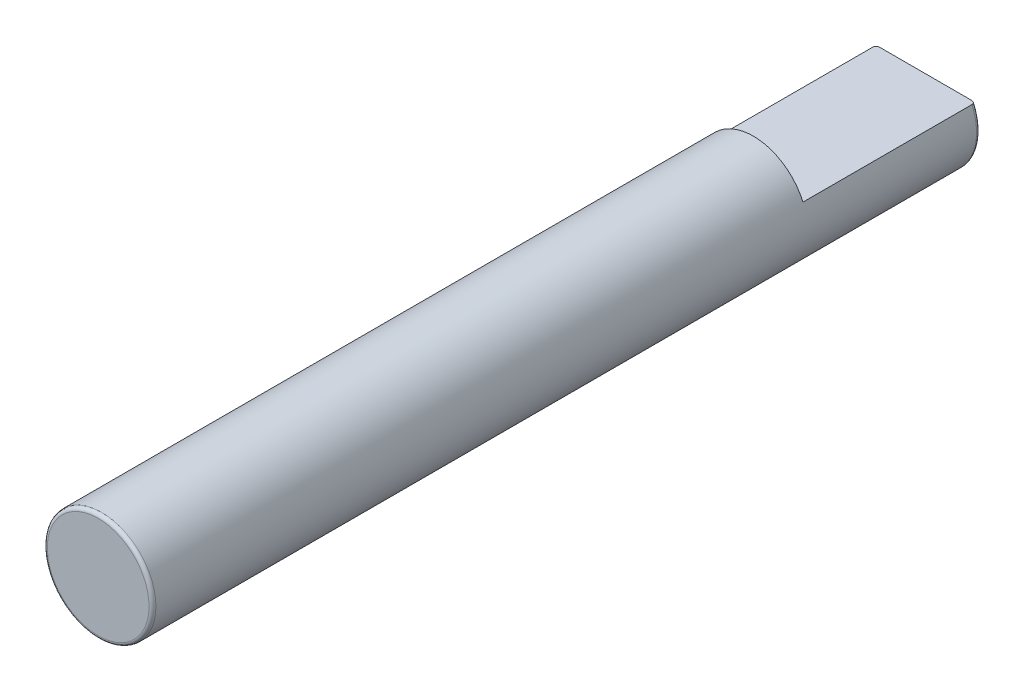
ISO-10303-21;
HEADER;
FILE_DESCRIPTION(('STEP AP214'),'2;1');
FILE_NAME('part.step','',(''),(''),'','','');
FILE_SCHEMA(('AUTOMOTIVE_DESIGN { 1 0 10303 214 1 1 1 1 }'));
ENDSEC;
DATA;
#1=APPLICATION_CONTEXT('core data for automotive mechanical design processes');
#2=APPLICATION_PROTOCOL_DEFINITION('international standard','automotive_design',2000,#1);
#3=PRODUCT_CONTEXT('',#1,'mechanical');
#4=PRODUCT('Part','Part','',(#3));
#5=PRODUCT_RELATED_PRODUCT_CATEGORY('part','',(#4));
#6=PRODUCT_DEFINITION_FORMATION('','',#4);
#7=PRODUCT_DEFINITION_CONTEXT('part definition',#1,'design');
#8=PRODUCT_DEFINITION('design','',#6,#7);
#9=PRODUCT_DEFINITION_SHAPE('','',#8);
#10=(LENGTH_UNIT() NAMED_UNIT(*) SI_UNIT(.MILLI.,.METRE.));
#11=(NAMED_UNIT(*) PLANE_ANGLE_UNIT() SI_UNIT($,.RADIAN.));
#12=(NAMED_UNIT(*) SI_UNIT($,.STERADIAN.) SOLID_ANGLE_UNIT());
#13=UNCERTAINTY_MEASURE_WITH_UNIT(LENGTH_MEASURE(1.E-05),#10,'distance_accuracy_value','');
#14=(GEOMETRIC_REPRESENTATION_CONTEXT(3) GLOBAL_UNCERTAINTY_ASSIGNED_CONTEXT((#13)) GLOBAL_UNIT_ASSIGNED_CONTEXT((#10,
#11,#12)) REPRESENTATION_CONTEXT('',''));
#15=CARTESIAN_POINT('',(0.,0.,0.));
#16=DIRECTION('',(0.,0.,1.));
#17=DIRECTION('',(1.,0.,0.));
#18=AXIS2_PLACEMENT_3D('',#15,#16,#17);
#19=CARTESIAN_POINT('',(0.,0.,60.9599999999998));
#20=DIRECTION('',(0.,0.,-0.999999999999996));
#21=DIRECTION('',(-0.999999999999998,0.,0.));
#22=AXIS2_PLACEMENT_3D('',#19,#20,#21);
#23=CYLINDRICAL_SURFACE('',#22,4.);
#24=CARTESIAN_POINT('',(0.,0.,60.7059999999998));
#25=DIRECTION('',(0.,0.,0.999999999999996));
#26=DIRECTION('',(0.999999999999998,0.,0.));
#27=AXIS2_PLACEMENT_3D('',#24,#25,#26);
#28=CIRCLE('',#27,4.);
#29=CARTESIAN_POINT('',(3.99999999999999,0.,60.7059999999998));
#30=VERTEX_POINT('',#29);
#31=EDGE_CURVE('E86',#30,#30,#28,.F.);
#32=ORIENTED_EDGE('',*,*,#31,.T.);
#33=EDGE_LOOP('',(#32));
#34=FACE_BOUND('',#33,.T.);
#35=DIRECTION('',(0.,0.,-0.999999999999996));
#36=VECTOR('',#35,1.);
#37=CARTESIAN_POINT('',(3.65782017566473,1.61875,60.9599999999998));
#38=LINE('',#37,#36);
#39=CARTESIAN_POINT('',(3.65782017566473,1.61875,12.6999999999999));
#40=VERTEX_POINT('',#39);
#41=CARTESIAN_POINT('',(3.65782017566474,1.61875,0.253999999999997));
#42=VERTEX_POINT('',#41);
#43=EDGE_CURVE('E49',#40,#42,#38,.T.);
#44=ORIENTED_EDGE('',*,*,#43,.F.);
#45=CARTESIAN_POINT('',(0.,0.,12.6999999999999));
#46=DIRECTION('',(0.,0.,0.999999999999996));
#47=DIRECTION('',(0.999999999999998,0.,0.));
#48=AXIS2_PLACEMENT_3D('',#45,#46,#47);
#49=CIRCLE('',#48,4.);
#50=CARTESIAN_POINT('',(-3.65782017566473,1.61875,12.6999999999999));
#51=VERTEX_POINT('',#50);
#52=EDGE_CURVE('E11',#40,#51,#49,.T.);
#53=ORIENTED_EDGE('',*,*,#52,.T.);
#54=DIRECTION('',(0.,0.,-0.999999999999996));
#55=VECTOR('',#54,1.);
#56=CARTESIAN_POINT('',(-3.65782017566473,1.61875,60.9599999999998));
#57=LINE('',#56,#55);
#58=CARTESIAN_POINT('',(-3.65782017566478,1.61875,0.25399999999999));
#59=VERTEX_POINT('',#58);
#60=EDGE_CURVE('E116',#59,#51,#57,.F.);
#61=ORIENTED_EDGE('',*,*,#60,.F.);
#62=CARTESIAN_POINT('',(0.,0.,0.253999999999997));
#63=DIRECTION('',(0.,0.,0.999999999999996));
#64=DIRECTION('',(0.999999999999998,0.,0.));
#65=AXIS2_PLACEMENT_3D('',#62,#63,#64);
#66=CIRCLE('',#65,4.);
#67=EDGE_CURVE('E82',#59,#42,#66,.T.);
#68=ORIENTED_EDGE('',*,*,#67,.T.);
#69=EDGE_LOOP('',(#44,#53,#61,#68));
#70=FACE_BOUND('',#69,.T.);
#71=ADVANCED_FACE('F34',(#34,#70),#23,.T.);
#72=CARTESIAN_POINT('',(0.,0.,0.));
#73=DIRECTION('',(0.,0.,0.999999999999996));
#74=DIRECTION('',(0.999999999999998,0.,0.));
#75=AXIS2_PLACEMENT_3D('',#72,#73,#74);
#76=PLANE('',#75);
#77=DIRECTION('',(-0.999999999999998,0.,0.));
#78=VECTOR('',#77,1.);
#79=CARTESIAN_POINT('',(-4.,1.61875,0.));
#80=LINE('',#79,#78);
#81=CARTESIAN_POINT('',(3.37818952066044,1.61875,0.));
#82=VERTEX_POINT('',#81);
#83=CARTESIAN_POINT('',(-3.37818952066021,1.61875,0.));
#84=VERTEX_POINT('',#83);
#85=EDGE_CURVE('E68',#82,#84,#80,.T.);
#86=ORIENTED_EDGE('',*,*,#85,.F.);
#87=CARTESIAN_POINT('',(0.,0.,0.));
#88=DIRECTION('',(0.,0.,0.999999999999996));
#89=DIRECTION('',(0.999999999999998,0.,0.));
#90=AXIS2_PLACEMENT_3D('',#87,#88,#89);
#91=CIRCLE('',#90,3.746);
#92=EDGE_CURVE('E78',#82,#84,#91,.F.);
#93=ORIENTED_EDGE('',*,*,#92,.T.);
#94=EDGE_LOOP('',(#86,#93));
#95=FACE_BOUND('',#94,.T.);
#96=ADVANCED_FACE('F77',(#95),#76,.F.);
#97=CARTESIAN_POINT('',(0.,0.,0.253999999999997));
#98=DIRECTION('',(0.,0.,0.999999999999996));
#99=DIRECTION('',(0.999999999999998,0.,0.));
#100=AXIS2_PLACEMENT_3D('',#97,#98,#99);
#101=TOROIDAL_SURFACE('',#100,3.746,0.254);
#102=ORIENTED_EDGE('',*,*,#67,.F.);
#103=CARTESIAN_POINT('',(-3.62181401029122,1.61875,0.128978152235386));
#104=CARTESIAN_POINT('',(-3.61398100741203,1.61875,0.116332868092589));
#105=CARTESIAN_POINT('',(-3.60499833058836,1.61875,0.104379057985489));
#106=CARTESIAN_POINT('',(-3.58510523117487,1.61875,0.0821753522248256));
#107=CARTESIAN_POINT('',(-3.57419032771626,1.61875,0.071929527040061));
#108=CARTESIAN_POINT('',(-3.55088235209229,1.61875,0.0534067069765182));
#109=CARTESIAN_POINT('',(-3.53849582960428,1.61875,0.0451214454608487));
#110=CARTESIAN_POINT('',(-3.51259207934814,1.61875,0.0305910436690785));
#111=CARTESIAN_POINT('',(-3.499075245087,1.61875,0.0243451970742181));
#112=CARTESIAN_POINT('',(-3.47026213419757,1.61875,0.0135799414975824));
#113=CARTESIAN_POINT('',(-3.45490774425881,1.61875,0.00921616349727985));
#114=CARTESIAN_POINT('',(-3.42370546383288,1.61875,0.00292866365241733));
#115=CARTESIAN_POINT('',(-3.40785734502239,1.61875,0.00100608842400553));
#116=CARTESIAN_POINT('',(-3.37486395077688,1.61875,-0.000451053260198092));
#117=CARTESIAN_POINT('',(-3.35771011762626,1.61875,0.000203257378076626));
#118=CARTESIAN_POINT('',(-3.32373504572483,1.61875,0.00430197449285581));
#119=CARTESIAN_POINT('',(-3.30691390441417,1.61875,0.00774718633750881));
#120=CARTESIAN_POINT('',(-3.27364563042085,1.61875,0.0175016071478172));
#121=CARTESIAN_POINT('',(-3.25721930953345,1.61875,0.0238823394233315));
#122=CARTESIAN_POINT('',(-3.22573916202948,1.61875,0.0394387348123291));
#123=CARTESIAN_POINT('',(-3.21068521983859,1.61875,0.0486141622886523));
#124=CARTESIAN_POINT('',(-3.1831849002841,1.61875,0.0691196856713148));
#125=CARTESIAN_POINT('',(-3.17065027930504,1.61875,0.0803308835619763));
#126=CARTESIAN_POINT('',(-3.14792190721115,1.61875,0.104921767549499));
#127=CARTESIAN_POINT('',(-3.13772619710203,1.61875,0.118299622783743));
#128=CARTESIAN_POINT('',(-3.12117462795611,1.61875,0.145306348564071));
#129=CARTESIAN_POINT('',(-3.11452425558573,1.61875,0.158754482092552));
#130=CARTESIAN_POINT('',(-3.10389679400881,1.61875,0.186667479671797));
#131=CARTESIAN_POINT('',(-3.09991729099644,1.61875,0.201131412593926));
#132=CARTESIAN_POINT('',(-3.09514752365418,1.61875,0.228944077381445));
#133=CARTESIAN_POINT('',(-3.09405601064955,1.61875,0.24224172558983));
#134=CARTESIAN_POINT('',(-3.09423765911792,1.61875,0.268819013521798));
#135=CARTESIAN_POINT('',(-3.09551009252322,1.61875,0.282098657529909));
#136=CARTESIAN_POINT('',(-3.10024145739033,1.61875,0.307636781843702));
#137=CARTESIAN_POINT('',(-3.10359906826337,1.61875,0.319914296348765));
#138=CARTESIAN_POINT('',(-3.11225527221652,1.61875,0.343762034653607));
#139=CARTESIAN_POINT('',(-3.11755405888834,1.61875,0.355332187774535));
#140=CARTESIAN_POINT('',(-3.13011150273258,1.61875,0.377921511844274));
#141=CARTESIAN_POINT('',(-3.13743599677487,1.61875,0.388903937975194));
#142=CARTESIAN_POINT('',(-3.15367608130174,1.61875,0.40961828405039));
#143=CARTESIAN_POINT('',(-3.16259221275837,1.61875,0.419349776882033));
#144=CARTESIAN_POINT('',(-3.1826404359309,1.61875,0.438261654854698));
#145=CARTESIAN_POINT('',(-3.19390194390374,1.61875,0.447304692491038));
#146=CARTESIAN_POINT('',(-3.21765700781537,1.61875,0.463591005191308));
#147=CARTESIAN_POINT('',(-3.23015110486586,1.61875,0.470833484847535));
#148=CARTESIAN_POINT('',(-3.25745815373513,1.61875,0.48412072664563));
#149=CARTESIAN_POINT('',(-3.27237569907739,1.61875,0.489950854321782));
#150=CARTESIAN_POINT('',(-3.30293418249766,1.61875,0.49923151068731));
#151=CARTESIAN_POINT('',(-3.31857542122114,1.61875,0.502681040754926));
#152=CARTESIAN_POINT('',(-3.35144851114196,1.61875,0.507330105142755));
#153=CARTESIAN_POINT('',(-3.368708721609,1.61875,0.508331376129597));
#154=CARTESIAN_POINT('',(-3.40316227055325,1.61875,0.507476394971046));
#155=CARTESIAN_POINT('',(-3.42035559292257,1.61875,0.505619492641897));
#156=CARTESIAN_POINT('',(-3.45446747244591,1.61875,0.498986906093992));
#157=CARTESIAN_POINT('',(-3.47137695924445,1.61875,0.494164058419906));
#158=CARTESIAN_POINT('',(-3.50407946280268,1.61875,0.481597414973423));
#159=CARTESIAN_POINT('',(-3.5198727015325,1.61875,0.473854201878129));
#160=CARTESIAN_POINT('',(-3.54898677094753,1.61875,0.456036639009788));
#161=CARTESIAN_POINT('',(-3.56239280191804,1.61875,0.446101993041197));
#162=CARTESIAN_POINT('',(-3.58713034734495,1.61875,0.423915186825961));
#163=CARTESIAN_POINT('',(-3.59846318683158,1.61875,0.411664517063966));
#164=CARTESIAN_POINT('',(-3.61760219650977,1.61875,0.38640260456888));
#165=CARTESIAN_POINT('',(-3.62563655293575,1.61875,0.373564302244797));
#166=CARTESIAN_POINT('',(-3.63919321751739,1.61875,0.346624240820025));
#167=CARTESIAN_POINT('',(-3.64471728080441,1.61875,0.332523372754929));
#168=CARTESIAN_POINT('',(-3.65261858051439,1.61875,0.304800146604606));
#169=CARTESIAN_POINT('',(-3.65522891154338,1.61875,0.29124391595927));
#170=CARTESIAN_POINT('',(-3.65801606285598,1.61875,0.263879903833329));
#171=CARTESIAN_POINT('',(-3.65819291019628,1.61875,0.250072125151271));
#172=CARTESIAN_POINT('',(-3.65615328996531,1.61875,0.22326775294229));
#173=CARTESIAN_POINT('',(-3.65404460975097,1.61875,0.210262698329947));
#174=CARTESIAN_POINT('',(-3.6476914105691,1.61875,0.184800623650788));
#175=CARTESIAN_POINT('',(-3.64345010213989,1.61875,0.172342810309825));
#176=CARTESIAN_POINT('',(-3.63587998810218,1.61875,0.154908360796537));
#177=CARTESIAN_POINT('',(-3.63332962291312,1.61875,0.149581126952593));
#178=CARTESIAN_POINT('',(-3.62785118410896,1.61875,0.139125683743482));
#179=CARTESIAN_POINT('',(-3.62492316477155,1.61875,0.133997445915469));
#180=CARTESIAN_POINT('',(-3.62181401029122,1.61875,0.128978152235386));
#181=B_SPLINE_CURVE_WITH_KNOTS('',3,(#103,#104,#105,#106,#107,#108,#109,#110,#111,#112,#113,
#114,#115,#116,#117,#118,#119,#120,#121,#122,#123,#124,#125,#126,#127,#128,#129,#130,#131,#132,
#133,#134,#135,#136,#137,#138,#139,#140,#141,#142,#143,#144,#145,#146,#147,#148,#149,#150,#151,
#152,#153,#154,#155,#156,#157,#158,#159,#160,#161,#162,#163,#164,#165,#166,#167,#168,#169,#170,
#171,#172,#173,#174,#175,#176,#177,#178,#179,#180),.UNSPECIFIED.,.T.,.F.,(4,2,2,2,2,2,2,2,2,2,2,
2,2,2,2,2,2,2,2,2,2,2,2,2,2,2,2,2,2,2,2,2,2,2,2,2,2,2,4),(0.,0.0446006683930118,
0.0893061548162654,0.133819642686237,0.178317697628841,0.226001785138876,0.273708261262,
0.324974214806307,0.376254967398297,0.428857340372456,0.48145527935891,0.531627259884261,
0.581757063331,0.626511473413867,0.671225381909631,0.711048088541356,0.750858532280906,
0.788871425204954,0.826888110152996,0.866325389994383,0.905776099545367,0.948927810930965,
0.99209855111631,1.03994429875017,1.08781010471284,1.13943992189654,1.19108148568421,
1.24356626451531,1.2960405770143,1.34582734410687,1.39558217916475,1.44077149653073,
1.48592916991068,1.52713470037598,1.56833977269723,1.60768288135366,1.64696693795985,
1.66467282687054,1.68237617386255),.UNSPECIFIED.);
#182=EDGE_CURVE('E42',#59,#84,#181,.T.);
#183=ORIENTED_EDGE('',*,*,#182,.T.);
#184=ORIENTED_EDGE('',*,*,#92,.F.);
#185=CARTESIAN_POINT('',(3.13034317773494,1.61875,0.130371957233907));
#186=CARTESIAN_POINT('',(3.13839747443689,1.61875,0.117533162173874));
#187=CARTESIAN_POINT('',(3.14764108889792,1.61875,0.105417931444454));
#188=CARTESIAN_POINT('',(3.16808370881694,1.61875,0.0829396574830406));
#189=CARTESIAN_POINT('',(3.17928794137144,1.61875,0.0725814477170629));
#190=CARTESIAN_POINT('',(3.20316399490995,1.61875,0.0538703022835363));
#191=CARTESIAN_POINT('',(3.21582804334547,1.61875,0.0455074134278668));
#192=CARTESIAN_POINT('',(3.24227954789428,1.61875,0.0308348386995946));
#193=CARTESIAN_POINT('',(3.25606651770586,1.61875,0.0245242698819539));
#194=CARTESIAN_POINT('',(3.28564404467436,1.61875,0.0135651973022127));
#195=CARTESIAN_POINT('',(3.30150494604995,1.61875,0.0091062731935187));
#196=CARTESIAN_POINT('',(3.33373474252849,1.61875,0.00273846028514944));
#197=CARTESIAN_POINT('',(3.35010389110342,1.61875,0.000830865479645672));
#198=CARTESIAN_POINT('',(3.38396219394872,1.61875,-0.000433251613529319));
#199=CARTESIAN_POINT('',(3.40145782876279,1.61875,0.000375838076135407));
#200=CARTESIAN_POINT('',(3.43606664310797,1.61875,0.00493431138370316));
#201=CARTESIAN_POINT('',(3.45317978156389,1.61875,0.00868400923965323));
#202=CARTESIAN_POINT('',(3.48639571846827,1.61875,0.0190716068750624));
#203=CARTESIAN_POINT('',(3.50250412904266,1.61875,0.0256914341618911));
#204=CARTESIAN_POINT('',(3.53326502219776,1.61875,0.0417335830406829));
#205=CARTESIAN_POINT('',(3.54791804170074,1.61875,0.0511548659594255));
#206=CARTESIAN_POINT('',(3.57423921364383,1.61875,0.0718784383303416));
#207=CARTESIAN_POINT('',(3.58604293434653,1.61875,0.0830081233504902));
#208=CARTESIAN_POINT('',(3.60736963865266,1.61875,0.107274549702716));
#209=CARTESIAN_POINT('',(3.61689420902809,1.61875,0.120409884179404));
#210=CARTESIAN_POINT('',(3.63242044846038,1.61875,0.146954934897744));
#211=CARTESIAN_POINT('',(3.63867156173112,1.61875,0.160218856478231));
#212=CARTESIAN_POINT('',(3.64864431308947,1.61875,0.187665388987166));
#213=CARTESIAN_POINT('',(3.65236737376046,1.61875,0.201847478315209));
#214=CARTESIAN_POINT('',(3.65692036816769,1.61875,0.229541857392628));
#215=CARTESIAN_POINT('',(3.65795138695942,1.61875,0.243021382166566));
#216=CARTESIAN_POINT('',(3.65766232327528,1.61875,0.269953689668082));
#217=CARTESIAN_POINT('',(3.65634276832219,1.61875,0.283406477717701));
#218=CARTESIAN_POINT('',(3.65148210004946,1.61875,0.309503440538761));
#219=CARTESIAN_POINT('',(3.64800547921946,1.61875,0.322159735666903));
#220=CARTESIAN_POINT('',(3.63902815652003,1.61875,0.346730559964342));
#221=CARTESIAN_POINT('',(3.63352733260823,1.61875,0.358645044358064));
#222=CARTESIAN_POINT('',(3.62053968515282,1.61875,0.381736908966185));
#223=CARTESIAN_POINT('',(3.61300576828472,1.61875,0.392887724144168));
#224=CARTESIAN_POINT('',(3.59628348079892,1.61875,0.413867795776895));
#225=CARTESIAN_POINT('',(3.58709469534384,1.61875,0.423696719782406));
#226=CARTESIAN_POINT('',(3.566676067186,1.61875,0.442471000443588));
#227=CARTESIAN_POINT('',(3.55535030606958,1.61875,0.451311896112469));
#228=CARTESIAN_POINT('',(3.53147660330034,1.61875,0.467147755228701));
#229=CARTESIAN_POINT('',(3.51892822783036,1.61875,0.474142060165337));
#230=CARTESIAN_POINT('',(3.49179120858802,1.61875,0.486733810952615));
#231=CARTESIAN_POINT('',(3.47712021898487,1.61875,0.492153811073807));
#232=CARTESIAN_POINT('',(3.44711717688314,1.61875,0.50066033619895));
#233=CARTESIAN_POINT('',(3.43178487038082,1.61875,0.503745956006175));
#234=CARTESIAN_POINT('',(3.39957867331268,1.61875,0.50772515698929));
#235=CARTESIAN_POINT('',(3.38268025122165,1.61875,0.50842167982394));
#236=CARTESIAN_POINT('',(3.3489883525918,1.61875,0.507089655497947));
#237=CARTESIAN_POINT('',(3.33219491214679,1.61875,0.50506021787734));
#238=CARTESIAN_POINT('',(3.29848028627019,1.61875,0.498175973858587));
#239=CARTESIAN_POINT('',(3.28158164787276,1.61875,0.493209691187999));
#240=CARTESIAN_POINT('',(3.24888705078697,1.61875,0.480434534465604));
#241=CARTESIAN_POINT('',(3.23309116236914,1.61875,0.472625479460508));
#242=CARTESIAN_POINT('',(3.20357117096325,1.61875,0.454534783644636));
#243=CARTESIAN_POINT('',(3.18980209281233,1.61875,0.444326916063163));
#244=CARTESIAN_POINT('',(3.1644030640058,1.61875,0.421520921251957));
#245=CARTESIAN_POINT('',(3.15277170075269,1.61875,0.40892438371436));
#246=CARTESIAN_POINT('',(3.13322928086671,1.61875,0.382972675815295));
#247=CARTESIAN_POINT('',(3.12506843827149,1.61875,0.369806063671296));
#248=CARTESIAN_POINT('',(3.11141487756136,1.61875,0.342156677858247));
#249=CARTESIAN_POINT('',(3.1059193649219,1.61875,0.327675301684349));
#250=CARTESIAN_POINT('',(3.09839356274576,1.61875,0.299638696182311));
#251=CARTESIAN_POINT('',(3.09603510652369,1.61875,0.286171060221083));
#252=CARTESIAN_POINT('',(3.09378728998864,1.61875,0.259028005312438));
#253=CARTESIAN_POINT('',(3.09389762836625,1.61875,0.245352611924814));
#254=CARTESIAN_POINT('',(3.09649236260838,1.61875,0.219128643453705));
#255=CARTESIAN_POINT('',(3.09882296290801,1.61875,0.206564337740496));
#256=CARTESIAN_POINT('',(3.10552457230202,1.61875,0.182007643022044));
#257=CARTESIAN_POINT('',(3.1098926080206,1.61875,0.170014448569238));
#258=CARTESIAN_POINT('',(3.11739455207491,1.61875,0.153614609623933));
#259=CARTESIAN_POINT('',(3.11977128258789,1.61875,0.148848163648749));
#260=CARTESIAN_POINT('',(3.12483085094726,1.61875,0.13948205435958));
#261=CARTESIAN_POINT('',(3.12751362228078,1.61875,0.134882355091251));
#262=CARTESIAN_POINT('',(3.13034317773494,1.61875,0.130371957233907));
#263=B_SPLINE_CURVE_WITH_KNOTS('',3,(#185,#186,#187,#188,#189,#190,#191,#192,#193,#194,#195,
#196,#197,#198,#199,#200,#201,#202,#203,#204,#205,#206,#207,#208,#209,#210,#211,#212,#213,#214,
#215,#216,#217,#218,#219,#220,#221,#222,#223,#224,#225,#226,#227,#228,#229,#230,#231,#232,#233,
#234,#235,#236,#237,#238,#239,#240,#241,#242,#243,#244,#245,#246,#247,#248,#249,#250,#251,#252,
#253,#254,#255,#256,#257,#258,#259,#260,#261,#262),.UNSPECIFIED.,.T.,.F.,(4,2,2,2,2,2,2,2,2,2,2,
2,2,2,2,2,2,2,2,2,2,2,2,2,2,2,2,2,2,2,2,2,2,2,2,2,2,2,4),(0.,0.0454465878241624,
0.0910162374601058,0.136353584859531,0.181671401433813,0.230886040408686,0.280125630822288,
0.332420066252598,0.384720090710726,0.436695471822343,0.488651606415995,0.537056145459689,
0.585426885985957,0.629181807957461,0.672912087750843,0.713267814002199,0.753614484641569,
0.792809408447018,0.832006695762704,0.872204140112423,0.912411675095333,0.955333894484817,
0.998271399708549,1.0449932565598,1.09173322135383,1.14224624378265,1.19277577076659,
1.24535891504751,1.2979454070313,1.34908809882037,1.40019687315568,1.44640500241456,
1.49256457843019,1.53336651508608,1.57416347200792,1.61232544103291,1.65043189097219,
1.66640119852286,1.6823670419986),.UNSPECIFIED.);
#264=EDGE_CURVE('E65',#82,#42,#263,.T.);
#265=ORIENTED_EDGE('',*,*,#264,.T.);
#266=EDGE_LOOP('',(#102,#183,#184,#265));
#267=FACE_BOUND('',#266,.T.);
#268=ADVANCED_FACE('F81',(#267),#101,.T.);
#269=CARTESIAN_POINT('',(0.,0.,60.9599999999998));
#270=DIRECTION('',(0.,0.,0.999999999999996));
#271=DIRECTION('',(0.999999999999998,0.,0.));
#272=AXIS2_PLACEMENT_3D('',#269,#270,#271);
#273=PLANE('',#272);
#274=CARTESIAN_POINT('',(0.,0.,60.9599999999998));
#275=DIRECTION('',(0.,0.,0.999999999999996));
#276=DIRECTION('',(0.999999999999998,0.,0.));
#277=AXIS2_PLACEMENT_3D('',#274,#275,#276);
#278=CIRCLE('',#277,3.746);
#279=CARTESIAN_POINT('',(3.74599999999999,0.,60.9599999999998));
#280=VERTEX_POINT('',#279);
#281=EDGE_CURVE('E73',#280,#280,#278,.T.);
#282=ORIENTED_EDGE('',*,*,#281,.T.);
#283=EDGE_LOOP('',(#282));
#284=FACE_BOUND('',#283,.T.);
#285=ADVANCED_FACE('F104',(#284),#273,.T.);
#286=CARTESIAN_POINT('',(0.,0.,60.7059999999998));
#287=DIRECTION('',(0.,0.,0.999999999999996));
#288=DIRECTION('',(0.999999999999998,0.,0.));
#289=AXIS2_PLACEMENT_3D('',#286,#287,#288);
#290=TOROIDAL_SURFACE('',#289,3.746,0.254);
#291=ORIENTED_EDGE('',*,*,#31,.F.);
#292=EDGE_LOOP('',(#291));
#293=FACE_BOUND('',#292,.T.);
#294=ORIENTED_EDGE('',*,*,#281,.F.);
#295=EDGE_LOOP('',(#294));
#296=FACE_BOUND('',#295,.T.);
#297=ADVANCED_FACE('F36',(#293,#296),#290,.T.);
#298=CARTESIAN_POINT('',(-4.,1.61875,12.6999999999999));
#299=DIRECTION('',(0.,0.,0.999999999999996));
#300=DIRECTION('',(0.999999999999998,0.,0.));
#301=AXIS2_PLACEMENT_3D('',#298,#299,#300);
#302=PLANE('',#301);
#303=DIRECTION('',(0.999999999999998,0.,0.));
#304=VECTOR('',#303,1.);
#305=CARTESIAN_POINT('',(-4.,1.61875,12.6999999999999));
#306=LINE('',#305,#304);
#307=EDGE_CURVE('E79',#51,#40,#306,.T.);
#308=ORIENTED_EDGE('',*,*,#307,.F.);
#309=ORIENTED_EDGE('',*,*,#52,.F.);
#310=EDGE_LOOP('',(#308,#309));
#311=FACE_BOUND('',#310,.T.);
#312=ADVANCED_FACE('F99',(#311),#302,.F.);
#313=CARTESIAN_POINT('',(0.,1.61875,0.));
#314=DIRECTION('',(0.,0.999999999999998,0.));
#315=DIRECTION('',(0.,0.,0.999999999999996));
#316=AXIS2_PLACEMENT_3D('',#313,#314,#315);
#317=PLANE('',#316);
#318=ORIENTED_EDGE('',*,*,#60,.T.);
#319=ORIENTED_EDGE('',*,*,#307,.T.);
#320=ORIENTED_EDGE('',*,*,#43,.T.);
#321=ORIENTED_EDGE('',*,*,#264,.F.);
#322=ORIENTED_EDGE('',*,*,#85,.T.);
#323=ORIENTED_EDGE('',*,*,#182,.F.);
#324=EDGE_LOOP('',(#318,#319,#320,#321,#322,#323));
#325=FACE_BOUND('',#324,.T.);
#326=ADVANCED_FACE('F67',(#325),#317,.T.);
#327=CLOSED_SHELL('',(#71,#96,#268,#285,#297,#312,#326));
#328=MANIFOLD_SOLID_BREP('B2',#327);
#329=ADVANCED_BREP_SHAPE_REPRESENTATION('',(#18,#328),#14);
#330=SHAPE_DEFINITION_REPRESENTATION(#9,#329);
ENDSEC;
END-ISO-10303-21;
